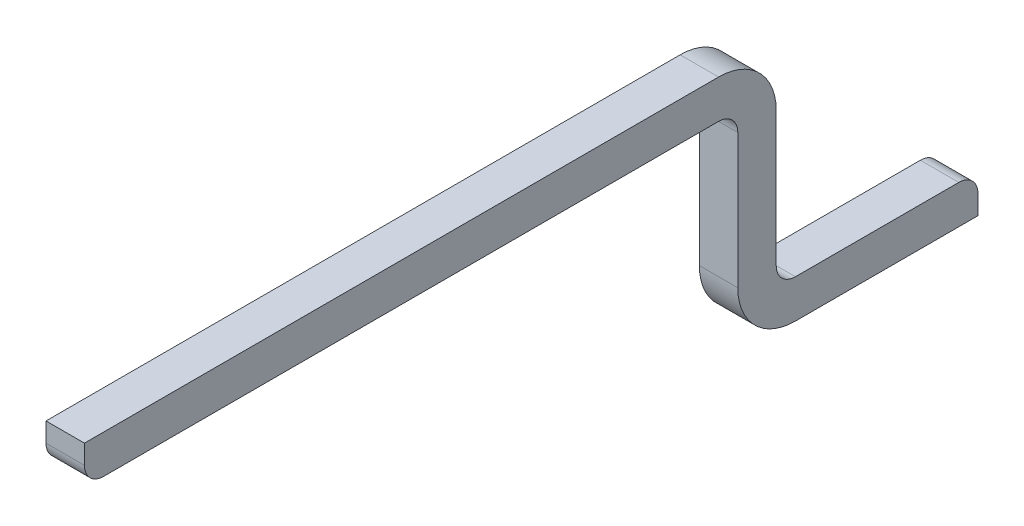
ISO-10303-21;
HEADER;
FILE_DESCRIPTION(('STEP AP214'),'2;1');
FILE_NAME('part.step','',(''),(''),'','','');
FILE_SCHEMA(('AUTOMOTIVE_DESIGN { 1 0 10303 214 1 1 1 1 }'));
ENDSEC;
DATA;
#1=APPLICATION_CONTEXT('core data for automotive mechanical design processes');
#2=APPLICATION_PROTOCOL_DEFINITION('international standard','automotive_design',2000,#1);
#3=PRODUCT_CONTEXT('',#1,'mechanical');
#4=PRODUCT('Part','Part','',(#3));
#5=PRODUCT_RELATED_PRODUCT_CATEGORY('part','',(#4));
#6=PRODUCT_DEFINITION_FORMATION('','',#4);
#7=PRODUCT_DEFINITION_CONTEXT('part definition',#1,'design');
#8=PRODUCT_DEFINITION('design','',#6,#7);
#9=PRODUCT_DEFINITION_SHAPE('','',#8);
#10=(LENGTH_UNIT() NAMED_UNIT(*) SI_UNIT(.MILLI.,.METRE.));
#11=(NAMED_UNIT(*) PLANE_ANGLE_UNIT() SI_UNIT($,.RADIAN.));
#12=(NAMED_UNIT(*) SI_UNIT($,.STERADIAN.) SOLID_ANGLE_UNIT());
#13=UNCERTAINTY_MEASURE_WITH_UNIT(LENGTH_MEASURE(1.E-05),#10,'distance_accuracy_value','');
#14=(GEOMETRIC_REPRESENTATION_CONTEXT(3) GLOBAL_UNCERTAINTY_ASSIGNED_CONTEXT((#13)) GLOBAL_UNIT_ASSIGNED_CONTEXT((#10,
#11,#12)) REPRESENTATION_CONTEXT('',''));
#15=CARTESIAN_POINT('',(0.,0.,0.));
#16=DIRECTION('',(0.,0.,1.));
#17=DIRECTION('',(1.,0.,0.));
#18=AXIS2_PLACEMENT_3D('',#15,#16,#17);
#19=CARTESIAN_POINT('',(-0.1,0.3,-4.5));
#20=DIRECTION('',(1.,0.,0.));
#21=DIRECTION('',(0.,0.,-1.));
#22=AXIS2_PLACEMENT_3D('',#19,#20,#21);
#23=PLANE('',#22);
#24=CARTESIAN_POINT('',(-0.1,0.1,-5.35));
#25=DIRECTION('',(-1.,0.,0.));
#26=DIRECTION('',(0.,0.,1.));
#27=AXIS2_PLACEMENT_3D('',#24,#25,#26);
#28=CIRCLE('',#27,0.1);
#29=CARTESIAN_POINT('',(-0.1,0.1,-5.45));
#30=VERTEX_POINT('',#29);
#31=CARTESIAN_POINT('',(-0.1,0.2,-5.35));
#32=VERTEX_POINT('',#31);
#33=EDGE_CURVE('E114',#30,#32,#28,.F.);
#34=ORIENTED_EDGE('',*,*,#33,.F.);
#35=DIRECTION('',(0.,1.,0.));
#36=VECTOR('',#35,1.);
#37=CARTESIAN_POINT('',(-0.1,0.3,-5.45));
#38=LINE('',#37,#36);
#39=CARTESIAN_POINT('',(-0.1,0.,-5.45));
#40=VERTEX_POINT('',#39);
#41=EDGE_CURVE('E137',#40,#30,#38,.T.);
#42=ORIENTED_EDGE('',*,*,#41,.F.);
#43=DIRECTION('',(0.,0.,-1.));
#44=VECTOR('',#43,1.);
#45=CARTESIAN_POINT('',(-0.1,0.,-4.5));
#46=LINE('',#45,#44);
#47=CARTESIAN_POINT('',(-0.1,0.,-4.5));
#48=VERTEX_POINT('',#47);
#49=EDGE_CURVE('E135',#48,#40,#46,.T.);
#50=ORIENTED_EDGE('',*,*,#49,.F.);
#51=CARTESIAN_POINT('',(-0.1,0.3,-4.5));
#52=DIRECTION('',(-1.,0.,0.));
#53=DIRECTION('',(0.,0.,1.));
#54=AXIS2_PLACEMENT_3D('',#51,#52,#53);
#55=CIRCLE('',#54,0.3);
#56=CARTESIAN_POINT('',(-0.1,0.3,-4.2));
#57=VERTEX_POINT('',#56);
#58=EDGE_CURVE('E131',#57,#48,#55,.F.);
#59=ORIENTED_EDGE('',*,*,#58,.F.);
#60=DIRECTION('',(0.,1.,0.));
#61=VECTOR('',#60,1.);
#62=CARTESIAN_POINT('',(-0.1,0.3,-4.2));
#63=LINE('',#62,#61);
#64=CARTESIAN_POINT('',(-0.1,1.,-4.2));
#65=VERTEX_POINT('',#64);
#66=EDGE_CURVE('E127',#65,#57,#63,.F.);
#67=ORIENTED_EDGE('',*,*,#66,.F.);
#68=CARTESIAN_POINT('',(-0.1,1.,-4.1));
#69=DIRECTION('',(-1.,0.,0.));
#70=DIRECTION('',(0.,0.,1.));
#71=AXIS2_PLACEMENT_3D('',#68,#69,#70);
#72=CIRCLE('',#71,0.1);
#73=CARTESIAN_POINT('',(-0.1,1.1,-4.1));
#74=VERTEX_POINT('',#73);
#75=EDGE_CURVE('E126',#74,#65,#72,.T.);
#76=ORIENTED_EDGE('',*,*,#75,.F.);
#77=DIRECTION('',(0.,0.,1.));
#78=VECTOR('',#77,1.);
#79=CARTESIAN_POINT('',(-0.1,1.1,-0.8));
#80=LINE('',#79,#78);
#81=CARTESIAN_POINT('',(-0.1,1.1,-0.9));
#82=VERTEX_POINT('',#81);
#83=EDGE_CURVE('E145',#74,#82,#80,.T.);
#84=ORIENTED_EDGE('',*,*,#83,.T.);
#85=CARTESIAN_POINT('',(-0.1,1.2,-0.9));
#86=DIRECTION('',(1.,0.,0.));
#87=DIRECTION('',(0.,0.,-1.));
#88=AXIS2_PLACEMENT_3D('',#85,#86,#87);
#89=CIRCLE('',#88,0.1);
#90=CARTESIAN_POINT('',(-0.1,1.2,-0.8));
#91=VERTEX_POINT('',#90);
#92=EDGE_CURVE('E142',#91,#82,#89,.T.);
#93=ORIENTED_EDGE('',*,*,#92,.F.);
#94=DIRECTION('',(0.,-1.,0.));
#95=VECTOR('',#94,1.);
#96=CARTESIAN_POINT('',(-0.1,1.1,-0.8));
#97=LINE('',#96,#95);
#98=CARTESIAN_POINT('',(-0.1,1.3,-0.8));
#99=VERTEX_POINT('',#98);
#100=EDGE_CURVE('E177',#99,#91,#97,.T.);
#101=ORIENTED_EDGE('',*,*,#100,.F.);
#102=DIRECTION('',(0.,0.,1.));
#103=VECTOR('',#102,1.);
#104=CARTESIAN_POINT('',(-0.1,1.3,-0.8));
#105=LINE('',#104,#103);
#106=CARTESIAN_POINT('',(-0.1,1.3,-4.1));
#107=VERTEX_POINT('',#106);
#108=EDGE_CURVE('E171',#107,#99,#105,.T.);
#109=ORIENTED_EDGE('',*,*,#108,.F.);
#110=CARTESIAN_POINT('',(-0.1,1.,-4.1));
#111=DIRECTION('',(-1.,0.,0.));
#112=DIRECTION('',(0.,0.,1.));
#113=AXIS2_PLACEMENT_3D('',#110,#111,#112);
#114=CIRCLE('',#113,0.3);
#115=CARTESIAN_POINT('',(-0.1,1.,-4.4));
#116=VERTEX_POINT('',#115);
#117=EDGE_CURVE('E138',#116,#107,#114,.F.);
#118=ORIENTED_EDGE('',*,*,#117,.F.);
#119=DIRECTION('',(0.,1.,0.));
#120=VECTOR('',#119,1.);
#121=CARTESIAN_POINT('',(-0.1,1.,-4.4));
#122=LINE('',#121,#120);
#123=CARTESIAN_POINT('',(-0.1,0.3,-4.4));
#124=VERTEX_POINT('',#123);
#125=EDGE_CURVE('E113',#124,#116,#122,.T.);
#126=ORIENTED_EDGE('',*,*,#125,.F.);
#127=CARTESIAN_POINT('',(-0.1,0.3,-4.5));
#128=DIRECTION('',(1.,0.,0.));
#129=DIRECTION('',(0.,0.,-1.));
#130=AXIS2_PLACEMENT_3D('',#127,#128,#129);
#131=CIRCLE('',#130,0.1);
#132=CARTESIAN_POINT('',(-0.1,0.2,-4.5));
#133=VERTEX_POINT('',#132);
#134=EDGE_CURVE('E19',#133,#124,#131,.F.);
#135=ORIENTED_EDGE('',*,*,#134,.F.);
#136=DIRECTION('',(0.,0.,-1.));
#137=VECTOR('',#136,1.);
#138=CARTESIAN_POINT('',(-0.1,0.2,-4.5));
#139=LINE('',#138,#137);
#140=EDGE_CURVE('E107',#32,#133,#139,.F.);
#141=ORIENTED_EDGE('',*,*,#140,.F.);
#142=EDGE_LOOP('',(#34,#42,#50,#59,#67,#76,#84,#93,#101,#109,#118,#126,#135,#141));
#143=FACE_BOUND('',#142,.T.);
#144=ADVANCED_FACE('F16',(#143),#23,.F.);
#145=CARTESIAN_POINT('',(0.1,1.,-4.4));
#146=DIRECTION('',(0.,0.,-1.));
#147=DIRECTION('',(-1.,0.,0.));
#148=AXIS2_PLACEMENT_3D('',#145,#146,#147);
#149=PLANE('',#148);
#150=DIRECTION('',(-1.,0.,0.));
#151=VECTOR('',#150,1.);
#152=CARTESIAN_POINT('',(0.1,1.,-4.4));
#153=LINE('',#152,#151);
#154=CARTESIAN_POINT('',(0.1,1.,-4.4));
#155=VERTEX_POINT('',#154);
#156=EDGE_CURVE('E141',#155,#116,#153,.T.);
#157=ORIENTED_EDGE('',*,*,#156,.F.);
#158=DIRECTION('',(0.,1.,0.));
#159=VECTOR('',#158,1.);
#160=CARTESIAN_POINT('',(0.1,0.3,-4.4));
#161=LINE('',#160,#159);
#162=CARTESIAN_POINT('',(0.1,0.3,-4.4));
#163=VERTEX_POINT('',#162);
#164=EDGE_CURVE('E151',#163,#155,#161,.T.);
#165=ORIENTED_EDGE('',*,*,#164,.F.);
#166=DIRECTION('',(1.,0.,0.));
#167=VECTOR('',#166,1.);
#168=CARTESIAN_POINT('',(0.1,0.3,-4.4));
#169=LINE('',#168,#167);
#170=EDGE_CURVE('E122',#163,#124,#169,.F.);
#171=ORIENTED_EDGE('',*,*,#170,.T.);
#172=ORIENTED_EDGE('',*,*,#125,.T.);
#173=EDGE_LOOP('',(#157,#165,#171,#172));
#174=FACE_BOUND('',#173,.T.);
#175=ADVANCED_FACE('F274',(#174),#149,.T.);
#176=CARTESIAN_POINT('',(0.1,1.,-4.1));
#177=DIRECTION('',(-1.,0.,0.));
#178=DIRECTION('',(0.,0.,1.));
#179=AXIS2_PLACEMENT_3D('',#176,#177,#178);
#180=CYLINDRICAL_SURFACE('',#179,0.3);
#181=CARTESIAN_POINT('',(0.1,1.,-4.1));
#182=DIRECTION('',(-1.,0.,0.));
#183=DIRECTION('',(0.,0.,1.));
#184=AXIS2_PLACEMENT_3D('',#181,#182,#183);
#185=CIRCLE('',#184,0.3);
#186=CARTESIAN_POINT('',(0.1,1.3,-4.1));
#187=VERTEX_POINT('',#186);
#188=EDGE_CURVE('E147',#155,#187,#185,.F.);
#189=ORIENTED_EDGE('',*,*,#188,.F.);
#190=ORIENTED_EDGE('',*,*,#156,.T.);
#191=ORIENTED_EDGE('',*,*,#117,.T.);
#192=DIRECTION('',(1.,0.,0.));
#193=VECTOR('',#192,1.);
#194=CARTESIAN_POINT('',(0.1,1.3,-4.1));
#195=LINE('',#194,#193);
#196=EDGE_CURVE('E174',#187,#107,#195,.F.);
#197=ORIENTED_EDGE('',*,*,#196,.F.);
#198=EDGE_LOOP('',(#189,#190,#191,#197));
#199=FACE_BOUND('',#198,.T.);
#200=ADVANCED_FACE('F272',(#199),#180,.T.);
#201=CARTESIAN_POINT('',(0.1,1.3,-0.8));
#202=DIRECTION('',(0.,1.,0.));
#203=DIRECTION('',(0.,0.,1.));
#204=AXIS2_PLACEMENT_3D('',#201,#202,#203);
#205=PLANE('',#204);
#206=DIRECTION('',(0.,0.,-1.));
#207=VECTOR('',#206,1.);
#208=CARTESIAN_POINT('',(0.1,1.3,-4.5));
#209=LINE('',#208,#207);
#210=CARTESIAN_POINT('',(0.1,1.3,-0.8));
#211=VERTEX_POINT('',#210);
#212=EDGE_CURVE('E150',#187,#211,#209,.F.);
#213=ORIENTED_EDGE('',*,*,#212,.F.);
#214=ORIENTED_EDGE('',*,*,#196,.T.);
#215=ORIENTED_EDGE('',*,*,#108,.T.);
#216=DIRECTION('',(1.,0.,0.));
#217=VECTOR('',#216,1.);
#218=CARTESIAN_POINT('',(0.1,1.3,-0.8));
#219=LINE('',#218,#217);
#220=EDGE_CURVE('E178',#211,#99,#219,.F.);
#221=ORIENTED_EDGE('',*,*,#220,.F.);
#222=EDGE_LOOP('',(#213,#214,#215,#221));
#223=FACE_BOUND('',#222,.T.);
#224=ADVANCED_FACE('F266',(#223),#205,.T.);
#225=CARTESIAN_POINT('',(0.1,1.1,-0.8));
#226=DIRECTION('',(0.,0.,1.));
#227=DIRECTION('',(0.,-1.,0.));
#228=AXIS2_PLACEMENT_3D('',#225,#226,#227);
#229=PLANE('',#228);
#230=DIRECTION('',(0.,1.,0.));
#231=VECTOR('',#230,1.);
#232=CARTESIAN_POINT('',(0.1,0.3,-0.8));
#233=LINE('',#232,#231);
#234=CARTESIAN_POINT('',(0.1,1.2,-0.8));
#235=VERTEX_POINT('',#234);
#236=EDGE_CURVE('E156',#211,#235,#233,.F.);
#237=ORIENTED_EDGE('',*,*,#236,.F.);
#238=ORIENTED_EDGE('',*,*,#220,.T.);
#239=ORIENTED_EDGE('',*,*,#100,.T.);
#240=DIRECTION('',(1.,0.,0.));
#241=VECTOR('',#240,1.);
#242=CARTESIAN_POINT('',(0.1,1.2,-0.8));
#243=LINE('',#242,#241);
#244=EDGE_CURVE('E146',#235,#91,#243,.F.);
#245=ORIENTED_EDGE('',*,*,#244,.F.);
#246=EDGE_LOOP('',(#237,#238,#239,#245));
#247=FACE_BOUND('',#246,.T.);
#248=ADVANCED_FACE('F268',(#247),#229,.T.);
#249=CARTESIAN_POINT('',(0.1,1.2,-0.9));
#250=DIRECTION('',(1.,0.,0.));
#251=DIRECTION('',(0.,0.,-1.));
#252=AXIS2_PLACEMENT_3D('',#249,#250,#251);
#253=CYLINDRICAL_SURFACE('',#252,0.1);
#254=ORIENTED_EDGE('',*,*,#92,.T.);
#255=DIRECTION('',(1.,0.,0.));
#256=VECTOR('',#255,1.);
#257=CARTESIAN_POINT('',(0.1,1.1,-0.9));
#258=LINE('',#257,#256);
#259=CARTESIAN_POINT('',(0.1,1.1,-0.9));
#260=VERTEX_POINT('',#259);
#261=EDGE_CURVE('E188',#82,#260,#258,.T.);
#262=ORIENTED_EDGE('',*,*,#261,.T.);
#263=CARTESIAN_POINT('',(0.1,1.2,-0.9));
#264=DIRECTION('',(1.,0.,0.));
#265=DIRECTION('',(0.,0.,-1.));
#266=AXIS2_PLACEMENT_3D('',#263,#264,#265);
#267=CIRCLE('',#266,0.1);
#268=EDGE_CURVE('E152',#235,#260,#267,.T.);
#269=ORIENTED_EDGE('',*,*,#268,.F.);
#270=ORIENTED_EDGE('',*,*,#244,.T.);
#271=EDGE_LOOP('',(#254,#262,#269,#270));
#272=FACE_BOUND('',#271,.T.);
#273=ADVANCED_FACE('F311',(#272),#253,.T.);
#274=CARTESIAN_POINT('',(0.1,1.1,-0.8));
#275=DIRECTION('',(0.,1.,0.));
#276=DIRECTION('',(0.,0.,1.));
#277=AXIS2_PLACEMENT_3D('',#274,#275,#276);
#278=PLANE('',#277);
#279=ORIENTED_EDGE('',*,*,#261,.F.);
#280=ORIENTED_EDGE('',*,*,#83,.F.);
#281=DIRECTION('',(-1.,0.,0.));
#282=VECTOR('',#281,1.);
#283=CARTESIAN_POINT('',(0.1,1.1,-4.1));
#284=LINE('',#283,#282);
#285=CARTESIAN_POINT('',(0.1,1.1,-4.1));
#286=VERTEX_POINT('',#285);
#287=EDGE_CURVE('E201',#74,#286,#284,.F.);
#288=ORIENTED_EDGE('',*,*,#287,.T.);
#289=DIRECTION('',(0.,0.,-1.));
#290=VECTOR('',#289,1.);
#291=CARTESIAN_POINT('',(0.1,1.1,-4.5));
#292=LINE('',#291,#290);
#293=EDGE_CURVE('E155',#260,#286,#292,.T.);
#294=ORIENTED_EDGE('',*,*,#293,.F.);
#295=EDGE_LOOP('',(#279,#280,#288,#294));
#296=FACE_BOUND('',#295,.T.);
#297=ADVANCED_FACE('F308',(#296),#278,.F.);
#298=CARTESIAN_POINT('',(0.1,1.,-4.1));
#299=DIRECTION('',(-1.,0.,0.));
#300=DIRECTION('',(0.,0.,1.));
#301=AXIS2_PLACEMENT_3D('',#298,#299,#300);
#302=CYLINDRICAL_SURFACE('',#301,0.1);
#303=DIRECTION('',(-1.,0.,0.));
#304=VECTOR('',#303,1.);
#305=CARTESIAN_POINT('',(0.1,1.,-4.2));
#306=LINE('',#305,#304);
#307=CARTESIAN_POINT('',(0.1,1.,-4.2));
#308=VERTEX_POINT('',#307);
#309=EDGE_CURVE('E203',#65,#308,#306,.F.);
#310=ORIENTED_EDGE('',*,*,#309,.T.);
#311=CARTESIAN_POINT('',(0.1,1.,-4.1));
#312=DIRECTION('',(-1.,0.,0.));
#313=DIRECTION('',(0.,0.,1.));
#314=AXIS2_PLACEMENT_3D('',#311,#312,#313);
#315=CIRCLE('',#314,0.1);
#316=EDGE_CURVE('E157',#286,#308,#315,.T.);
#317=ORIENTED_EDGE('',*,*,#316,.F.);
#318=ORIENTED_EDGE('',*,*,#287,.F.);
#319=ORIENTED_EDGE('',*,*,#75,.T.);
#320=EDGE_LOOP('',(#310,#317,#318,#319));
#321=FACE_BOUND('',#320,.T.);
#322=ADVANCED_FACE('F304',(#321),#302,.F.);
#323=CARTESIAN_POINT('',(0.1,1.,-4.2));
#324=DIRECTION('',(0.,0.,-1.));
#325=DIRECTION('',(-1.,0.,0.));
#326=AXIS2_PLACEMENT_3D('',#323,#324,#325);
#327=PLANE('',#326);
#328=DIRECTION('',(-1.,0.,0.));
#329=VECTOR('',#328,1.);
#330=CARTESIAN_POINT('',(0.1,0.3,-4.2));
#331=LINE('',#330,#329);
#332=CARTESIAN_POINT('',(0.1,0.3,-4.2));
#333=VERTEX_POINT('',#332);
#334=EDGE_CURVE('E205',#333,#57,#331,.T.);
#335=ORIENTED_EDGE('',*,*,#334,.F.);
#336=DIRECTION('',(0.,1.,0.));
#337=VECTOR('',#336,1.);
#338=CARTESIAN_POINT('',(0.1,0.3,-4.2));
#339=LINE('',#338,#337);
#340=EDGE_CURVE('E160',#308,#333,#339,.F.);
#341=ORIENTED_EDGE('',*,*,#340,.F.);
#342=ORIENTED_EDGE('',*,*,#309,.F.);
#343=ORIENTED_EDGE('',*,*,#66,.T.);
#344=EDGE_LOOP('',(#335,#341,#342,#343));
#345=FACE_BOUND('',#344,.T.);
#346=ADVANCED_FACE('F300',(#345),#327,.F.);
#347=CARTESIAN_POINT('',(0.1,0.3,-4.5));
#348=DIRECTION('',(-1.,0.,0.));
#349=DIRECTION('',(0.,0.,1.));
#350=AXIS2_PLACEMENT_3D('',#347,#348,#349);
#351=CYLINDRICAL_SURFACE('',#350,0.3);
#352=CARTESIAN_POINT('',(0.1,0.3,-4.5));
#353=DIRECTION('',(-1.,0.,0.));
#354=DIRECTION('',(0.,0.,1.));
#355=AXIS2_PLACEMENT_3D('',#352,#353,#354);
#356=CIRCLE('',#355,0.3);
#357=CARTESIAN_POINT('',(0.1,0.,-4.5));
#358=VERTEX_POINT('',#357);
#359=EDGE_CURVE('E161',#333,#358,#356,.F.);
#360=ORIENTED_EDGE('',*,*,#359,.F.);
#361=ORIENTED_EDGE('',*,*,#334,.T.);
#362=ORIENTED_EDGE('',*,*,#58,.T.);
#363=DIRECTION('',(1.,0.,0.));
#364=VECTOR('',#363,1.);
#365=CARTESIAN_POINT('',(0.1,0.,-4.5));
#366=LINE('',#365,#364);
#367=EDGE_CURVE('E208',#48,#358,#366,.T.);
#368=ORIENTED_EDGE('',*,*,#367,.T.);
#369=EDGE_LOOP('',(#360,#361,#362,#368));
#370=FACE_BOUND('',#369,.T.);
#371=ADVANCED_FACE('F297',(#370),#351,.T.);
#372=CARTESIAN_POINT('',(0.1,0.,-4.5));
#373=DIRECTION('',(0.,1.,0.));
#374=DIRECTION('',(0.,0.,1.));
#375=AXIS2_PLACEMENT_3D('',#372,#373,#374);
#376=PLANE('',#375);
#377=DIRECTION('',(-1.,0.,0.));
#378=VECTOR('',#377,1.);
#379=CARTESIAN_POINT('',(0.1,0.,-5.45));
#380=LINE('',#379,#378);
#381=CARTESIAN_POINT('',(0.1,0.,-5.45));
#382=VERTEX_POINT('',#381);
#383=EDGE_CURVE('E210',#382,#40,#380,.T.);
#384=ORIENTED_EDGE('',*,*,#383,.F.);
#385=DIRECTION('',(0.,0.,-1.));
#386=VECTOR('',#385,1.);
#387=CARTESIAN_POINT('',(0.1,0.,-4.5));
#388=LINE('',#387,#386);
#389=EDGE_CURVE('E164',#358,#382,#388,.T.);
#390=ORIENTED_EDGE('',*,*,#389,.F.);
#391=ORIENTED_EDGE('',*,*,#367,.F.);
#392=ORIENTED_EDGE('',*,*,#49,.T.);
#393=EDGE_LOOP('',(#384,#390,#391,#392));
#394=FACE_BOUND('',#393,.T.);
#395=ADVANCED_FACE('F256',(#394),#376,.F.);
#396=CARTESIAN_POINT('',(0.1,0.2,-5.45));
#397=DIRECTION('',(0.,0.,-1.));
#398=DIRECTION('',(-1.,0.,0.));
#399=AXIS2_PLACEMENT_3D('',#396,#397,#398);
#400=PLANE('',#399);
#401=DIRECTION('',(0.,1.,0.));
#402=VECTOR('',#401,1.);
#403=CARTESIAN_POINT('',(0.1,0.3,-5.45));
#404=LINE('',#403,#402);
#405=CARTESIAN_POINT('',(0.1,0.1,-5.45));
#406=VERTEX_POINT('',#405);
#407=EDGE_CURVE('E167',#382,#406,#404,.T.);
#408=ORIENTED_EDGE('',*,*,#407,.F.);
#409=ORIENTED_EDGE('',*,*,#383,.T.);
#410=ORIENTED_EDGE('',*,*,#41,.T.);
#411=DIRECTION('',(-1.,0.,0.));
#412=VECTOR('',#411,1.);
#413=CARTESIAN_POINT('',(0.1,0.1,-5.45));
#414=LINE('',#413,#412);
#415=EDGE_CURVE('E215',#406,#30,#414,.T.);
#416=ORIENTED_EDGE('',*,*,#415,.F.);
#417=EDGE_LOOP('',(#408,#409,#410,#416));
#418=FACE_BOUND('',#417,.T.);
#419=ADVANCED_FACE('F252',(#418),#400,.T.);
#420=CARTESIAN_POINT('',(0.1,0.1,-5.35));
#421=DIRECTION('',(-1.,0.,0.));
#422=DIRECTION('',(0.,0.,1.));
#423=AXIS2_PLACEMENT_3D('',#420,#421,#422);
#424=CYLINDRICAL_SURFACE('',#423,0.1);
#425=ORIENTED_EDGE('',*,*,#33,.T.);
#426=DIRECTION('',(1.,0.,0.));
#427=VECTOR('',#426,1.);
#428=CARTESIAN_POINT('',(0.1,0.2,-5.35));
#429=LINE('',#428,#427);
#430=CARTESIAN_POINT('',(0.1,0.2,-5.35));
#431=VERTEX_POINT('',#430);
#432=EDGE_CURVE('E109',#431,#32,#429,.F.);
#433=ORIENTED_EDGE('',*,*,#432,.F.);
#434=CARTESIAN_POINT('',(0.1,0.1,-5.35));
#435=DIRECTION('',(-1.,0.,0.));
#436=DIRECTION('',(0.,0.,1.));
#437=AXIS2_PLACEMENT_3D('',#434,#435,#436);
#438=CIRCLE('',#437,0.1);
#439=EDGE_CURVE('E165',#406,#431,#438,.F.);
#440=ORIENTED_EDGE('',*,*,#439,.F.);
#441=ORIENTED_EDGE('',*,*,#415,.T.);
#442=EDGE_LOOP('',(#425,#433,#440,#441));
#443=FACE_BOUND('',#442,.T.);
#444=ADVANCED_FACE('F247',(#443),#424,.T.);
#445=CARTESIAN_POINT('',(0.1,0.2,-4.75));
#446=DIRECTION('',(0.,1.,0.));
#447=DIRECTION('',(0.,0.,1.));
#448=AXIS2_PLACEMENT_3D('',#445,#446,#447);
#449=PLANE('',#448);
#450=ORIENTED_EDGE('',*,*,#432,.T.);
#451=ORIENTED_EDGE('',*,*,#140,.T.);
#452=DIRECTION('',(1.,0.,0.));
#453=VECTOR('',#452,1.);
#454=CARTESIAN_POINT('',(0.1,0.2,-4.5));
#455=LINE('',#454,#453);
#456=CARTESIAN_POINT('',(0.1,0.2,-4.5));
#457=VERTEX_POINT('',#456);
#458=EDGE_CURVE('E34',#133,#457,#455,.T.);
#459=ORIENTED_EDGE('',*,*,#458,.T.);
#460=DIRECTION('',(0.,0.,-1.));
#461=VECTOR('',#460,1.);
#462=CARTESIAN_POINT('',(0.1,0.2,-4.5));
#463=LINE('',#462,#461);
#464=EDGE_CURVE('E25',#431,#457,#463,.F.);
#465=ORIENTED_EDGE('',*,*,#464,.F.);
#466=EDGE_LOOP('',(#450,#451,#459,#465));
#467=FACE_BOUND('',#466,.T.);
#468=ADVANCED_FACE('F108',(#467),#449,.T.);
#469=CARTESIAN_POINT('',(0.1,0.3,-4.5));
#470=DIRECTION('',(1.,0.,0.));
#471=DIRECTION('',(0.,0.,-1.));
#472=AXIS2_PLACEMENT_3D('',#469,#470,#471);
#473=CYLINDRICAL_SURFACE('',#472,0.1);
#474=ORIENTED_EDGE('',*,*,#170,.F.);
#475=CARTESIAN_POINT('',(0.1,0.3,-4.5));
#476=DIRECTION('',(1.,0.,0.));
#477=DIRECTION('',(0.,0.,-1.));
#478=AXIS2_PLACEMENT_3D('',#475,#476,#477);
#479=CIRCLE('',#478,0.1);
#480=EDGE_CURVE('E11',#457,#163,#479,.F.);
#481=ORIENTED_EDGE('',*,*,#480,.F.);
#482=ORIENTED_EDGE('',*,*,#458,.F.);
#483=ORIENTED_EDGE('',*,*,#134,.T.);
#484=EDGE_LOOP('',(#474,#481,#482,#483));
#485=FACE_BOUND('',#484,.T.);
#486=ADVANCED_FACE('F119',(#485),#473,.F.);
#487=CARTESIAN_POINT('',(0.1,0.3,-4.5));
#488=DIRECTION('',(1.,0.,0.));
#489=DIRECTION('',(0.,0.,-1.));
#490=AXIS2_PLACEMENT_3D('',#487,#488,#489);
#491=PLANE('',#490);
#492=ORIENTED_EDGE('',*,*,#464,.T.);
#493=ORIENTED_EDGE('',*,*,#480,.T.);
#494=ORIENTED_EDGE('',*,*,#164,.T.);
#495=ORIENTED_EDGE('',*,*,#188,.T.);
#496=ORIENTED_EDGE('',*,*,#212,.T.);
#497=ORIENTED_EDGE('',*,*,#236,.T.);
#498=ORIENTED_EDGE('',*,*,#268,.T.);
#499=ORIENTED_EDGE('',*,*,#293,.T.);
#500=ORIENTED_EDGE('',*,*,#316,.T.);
#501=ORIENTED_EDGE('',*,*,#340,.T.);
#502=ORIENTED_EDGE('',*,*,#359,.T.);
#503=ORIENTED_EDGE('',*,*,#389,.T.);
#504=ORIENTED_EDGE('',*,*,#407,.T.);
#505=ORIENTED_EDGE('',*,*,#439,.T.);
#506=EDGE_LOOP('',(#492,#493,#494,#495,#496,#497,#498,#499,#500,#501,#502,#503,#504,#505));
#507=FACE_BOUND('',#506,.T.);
#508=ADVANCED_FACE('F243',(#507),#491,.T.);
#509=CLOSED_SHELL('',(#144,#175,#200,#224,#248,#273,#297,#322,#346,#371,#395,#419,#444,#468,
#486,#508));
#510=MANIFOLD_SOLID_BREP('B1',#509);
#511=ADVANCED_BREP_SHAPE_REPRESENTATION('',(#18,#510),#14);
#512=SHAPE_DEFINITION_REPRESENTATION(#9,#511);
ENDSEC;
END-ISO-10303-21;
